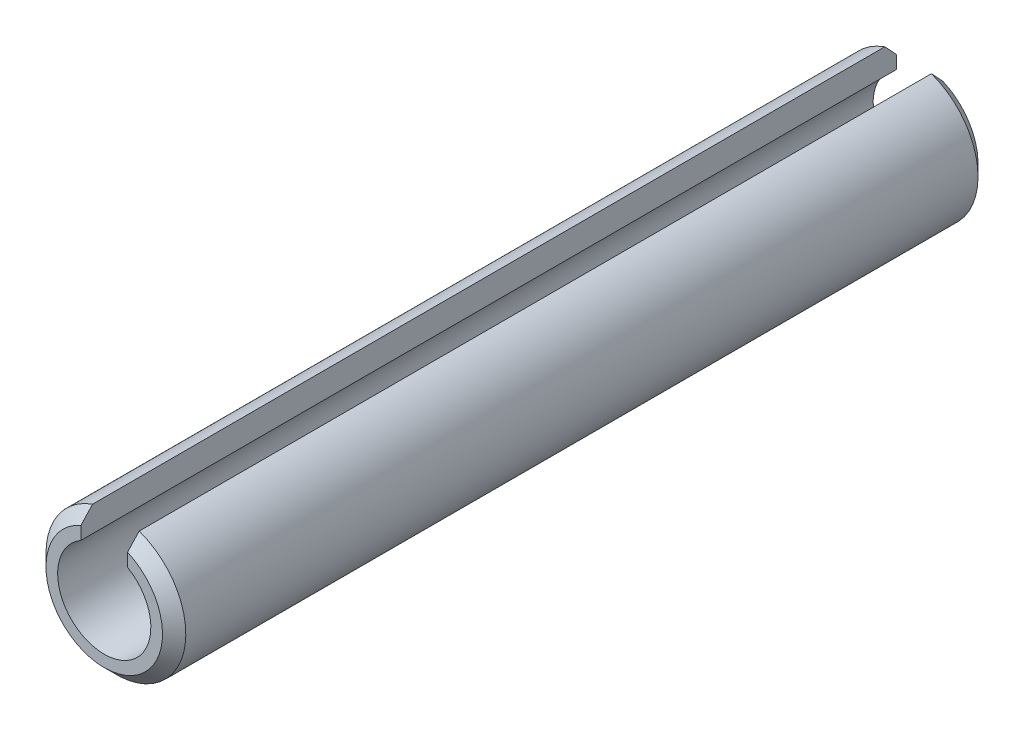
ISO-10303-21;
HEADER;
FILE_DESCRIPTION(('STEP AP214'),'2;1');
FILE_NAME('part.step','',(''),(''),'','','');
FILE_SCHEMA(('AUTOMOTIVE_DESIGN { 1 0 10303 214 1 1 1 1 }'));
ENDSEC;
DATA;
#1=APPLICATION_CONTEXT('core data for automotive mechanical design processes');
#2=APPLICATION_PROTOCOL_DEFINITION('international standard','automotive_design',2000,#1);
#3=PRODUCT_CONTEXT('',#1,'mechanical');
#4=PRODUCT('Part','Part','',(#3));
#5=PRODUCT_RELATED_PRODUCT_CATEGORY('part','',(#4));
#6=PRODUCT_DEFINITION_FORMATION('','',#4);
#7=PRODUCT_DEFINITION_CONTEXT('part definition',#1,'design');
#8=PRODUCT_DEFINITION('design','',#6,#7);
#9=PRODUCT_DEFINITION_SHAPE('','',#8);
#10=(LENGTH_UNIT() NAMED_UNIT(*) SI_UNIT(.MILLI.,.METRE.));
#11=(NAMED_UNIT(*) PLANE_ANGLE_UNIT() SI_UNIT($,.RADIAN.));
#12=(NAMED_UNIT(*) SI_UNIT($,.STERADIAN.) SOLID_ANGLE_UNIT());
#13=UNCERTAINTY_MEASURE_WITH_UNIT(LENGTH_MEASURE(1.E-05),#10,'distance_accuracy_value','');
#14=(GEOMETRIC_REPRESENTATION_CONTEXT(3) GLOBAL_UNCERTAINTY_ASSIGNED_CONTEXT((#13)) GLOBAL_UNIT_ASSIGNED_CONTEXT((#10,
#11,#12)) REPRESENTATION_CONTEXT('',''));
#15=CARTESIAN_POINT('',(0.,0.,0.));
#16=DIRECTION('',(0.,0.,1.));
#17=DIRECTION('',(1.,0.,0.));
#18=AXIS2_PLACEMENT_3D('',#15,#16,#17);
#19=CARTESIAN_POINT('',(0.,0.,35.));
#20=DIRECTION('',(0.,0.,-1.));
#21=DIRECTION('',(-1.,0.,0.));
#22=AXIS2_PLACEMENT_3D('',#19,#20,#21);
#23=CYLINDRICAL_SURFACE('',#22,3.);
#24=DIRECTION('',(0.,0.,-1.));
#25=VECTOR('',#24,1.);
#26=CARTESIAN_POINT('',(-0.999999999999997,2.82842712474619,35.));
#27=LINE('',#26,#25);
#28=CARTESIAN_POINT('',(-0.999999999999997,2.82842712474619,34.5));
#29=VERTEX_POINT('',#28);
#30=CARTESIAN_POINT('',(-0.999999999999997,2.82842712474619,0.5));
#31=VERTEX_POINT('',#30);
#32=EDGE_CURVE('E116',#29,#31,#27,.T.);
#33=ORIENTED_EDGE('',*,*,#32,.T.);
#34=CARTESIAN_POINT('',(0.,0.,0.5));
#35=DIRECTION('',(0.,0.,1.));
#36=DIRECTION('',(1.,0.,0.));
#37=AXIS2_PLACEMENT_3D('',#34,#35,#36);
#38=CIRCLE('',#37,3.);
#39=CARTESIAN_POINT('',(1.,2.82842712474619,0.500000000000001));
#40=VERTEX_POINT('',#39);
#41=EDGE_CURVE('E123',#31,#40,#38,.T.);
#42=ORIENTED_EDGE('',*,*,#41,.T.);
#43=DIRECTION('',(0.,0.,-1.));
#44=VECTOR('',#43,1.);
#45=CARTESIAN_POINT('',(1.,2.82842712474619,35.));
#46=LINE('',#45,#44);
#47=CARTESIAN_POINT('',(1.,2.82842712474619,34.5));
#48=VERTEX_POINT('',#47);
#49=EDGE_CURVE('E103',#48,#40,#46,.T.);
#50=ORIENTED_EDGE('',*,*,#49,.F.);
#51=CARTESIAN_POINT('',(0.,0.,34.5));
#52=DIRECTION('',(0.,0.,1.));
#53=DIRECTION('',(1.,0.,0.));
#54=AXIS2_PLACEMENT_3D('',#51,#52,#53);
#55=CIRCLE('',#54,3.);
#56=EDGE_CURVE('E121',#48,#29,#55,.F.);
#57=ORIENTED_EDGE('',*,*,#56,.T.);
#58=EDGE_LOOP('',(#33,#42,#50,#57));
#59=FACE_BOUND('',#58,.T.);
#60=ADVANCED_FACE('F32',(#59),#23,.T.);
#61=CARTESIAN_POINT('',(1.,2.82842712474619,35.));
#62=DIRECTION('',(1.,0.,0.));
#63=DIRECTION('',(0.,0.,-1.));
#64=AXIS2_PLACEMENT_3D('',#61,#62,#63);
#65=PLANE('',#64);
#66=ORIENTED_EDGE('',*,*,#49,.T.);
#67=CARTESIAN_POINT('',(1.,2.82842712474619,0.5));
#68=CARTESIAN_POINT('',(1.,2.78393060243607,0.458049299682896));
#69=CARTESIAN_POINT('',(1.,2.73938013855693,0.416155705079881));
#70=CARTESIAN_POINT('',(1.,2.65015403367117,0.332503146617472));
#71=CARTESIAN_POINT('',(1.,2.60547839420257,0.29074418111735));
#72=CARTESIAN_POINT('',(1.,2.51598341720938,0.207380143208967));
#73=CARTESIAN_POINT('',(1.,2.47116407923848,0.165775071279564));
#74=CARTESIAN_POINT('',(1.,2.38135760243373,0.0827453555177404));
#75=CARTESIAN_POINT('',(1.,2.33637046155039,0.0413207139025472));
#76=CARTESIAN_POINT('',(1.,2.29128784747792,0.));
#77=B_SPLINE_CURVE_WITH_KNOTS('',3,(#67,#68,#69,#70,#71,#72,#73,#74,#75,#76),.UNSPECIFIED.,.F.,
.F.,(4,2,2,2,4),(0.,0.183461811793637,0.366921379215902,0.550381517014302,0.733843902947407),.UNSPECIFIED.);
#78=CARTESIAN_POINT('',(1.,2.29128784747792,0.));
#79=VERTEX_POINT('',#78);
#80=EDGE_CURVE('E94',#40,#79,#77,.T.);
#81=ORIENTED_EDGE('',*,*,#80,.T.);
#82=DIRECTION('',(0.,-1.,0.));
#83=VECTOR('',#82,1.);
#84=CARTESIAN_POINT('',(1.,2.82842712474619,0.));
#85=LINE('',#84,#83);
#86=CARTESIAN_POINT('',(1.,1.73205080756888,0.));
#87=VERTEX_POINT('',#86);
#88=EDGE_CURVE('E87',#79,#87,#85,.T.);
#89=ORIENTED_EDGE('',*,*,#88,.T.);
#90=DIRECTION('',(0.,0.,-1.));
#91=VECTOR('',#90,1.);
#92=CARTESIAN_POINT('',(1.,1.73205080756888,35.));
#93=LINE('',#92,#91);
#94=CARTESIAN_POINT('',(1.,1.73205080756888,35.));
#95=VERTEX_POINT('',#94);
#96=EDGE_CURVE('E92',#95,#87,#93,.T.);
#97=ORIENTED_EDGE('',*,*,#96,.F.);
#98=DIRECTION('',(0.,-1.,0.));
#99=VECTOR('',#98,1.);
#100=CARTESIAN_POINT('',(1.,2.82842712474619,35.));
#101=LINE('',#100,#99);
#102=CARTESIAN_POINT('',(1.,2.29128784747792,35.));
#103=VERTEX_POINT('',#102);
#104=EDGE_CURVE('E109',#103,#95,#101,.T.);
#105=ORIENTED_EDGE('',*,*,#104,.F.);
#106=CARTESIAN_POINT('',(1.,2.29128784747792,35.));
#107=CARTESIAN_POINT('',(1.,2.33637046155038,34.9586792860974));
#108=CARTESIAN_POINT('',(1.,2.38135760243373,34.9172546444823));
#109=CARTESIAN_POINT('',(1.,2.47116407923848,34.8342249287204));
#110=CARTESIAN_POINT('',(1.,2.51598341720938,34.792619856791));
#111=CARTESIAN_POINT('',(1.,2.60547839420257,34.7092558188827));
#112=CARTESIAN_POINT('',(1.,2.65015403367117,34.6674968533825));
#113=CARTESIAN_POINT('',(1.,2.73938013855693,34.5838442949201));
#114=CARTESIAN_POINT('',(1.,2.78393060243607,34.5419507003171));
#115=CARTESIAN_POINT('',(1.,2.82842712474619,34.5));
#116=B_SPLINE_CURVE_WITH_KNOTS('',3,(#106,#107,#108,#109,#110,#111,#112,#113,#114,#115),
.UNSPECIFIED.,.F.,.F.,(4,2,2,2,4),(0.,0.183462385933106,0.366922523731505,0.550382091153768,
0.733843902947405),.UNSPECIFIED.);
#117=EDGE_CURVE('E126',#103,#48,#116,.T.);
#118=ORIENTED_EDGE('',*,*,#117,.T.);
#119=EDGE_LOOP('',(#66,#81,#89,#97,#105,#118));
#120=FACE_BOUND('',#119,.T.);
#121=ADVANCED_FACE('F90',(#120),#65,.F.);
#122=CARTESIAN_POINT('',(0.,0.,35.));
#123=DIRECTION('',(0.,0.,-1.));
#124=DIRECTION('',(-1.,0.,0.));
#125=AXIS2_PLACEMENT_3D('',#122,#123,#124);
#126=CYLINDRICAL_SURFACE('',#125,2.);
#127=CARTESIAN_POINT('',(0.,0.,0.));
#128=DIRECTION('',(0.,0.,-1.));
#129=DIRECTION('',(1.,0.,0.));
#130=AXIS2_PLACEMENT_3D('',#127,#128,#129);
#131=CIRCLE('',#130,2.);
#132=CARTESIAN_POINT('',(-0.999999999999998,1.73205080756888,0.));
#133=VERTEX_POINT('',#132);
#134=EDGE_CURVE('E96',#87,#133,#131,.T.);
#135=ORIENTED_EDGE('',*,*,#134,.T.);
#136=DIRECTION('',(0.,0.,-1.));
#137=VECTOR('',#136,1.);
#138=CARTESIAN_POINT('',(-0.999999999999998,1.73205080756888,35.));
#139=LINE('',#138,#137);
#140=CARTESIAN_POINT('',(-0.999999999999998,1.73205080756888,35.));
#141=VERTEX_POINT('',#140);
#142=EDGE_CURVE('E104',#141,#133,#139,.T.);
#143=ORIENTED_EDGE('',*,*,#142,.F.);
#144=CARTESIAN_POINT('',(0.,0.,35.));
#145=DIRECTION('',(0.,0.,-1.));
#146=DIRECTION('',(1.,0.,0.));
#147=AXIS2_PLACEMENT_3D('',#144,#145,#146);
#148=CIRCLE('',#147,2.);
#149=EDGE_CURVE('E102',#95,#141,#148,.T.);
#150=ORIENTED_EDGE('',*,*,#149,.F.);
#151=ORIENTED_EDGE('',*,*,#96,.T.);
#152=EDGE_LOOP('',(#135,#143,#150,#151));
#153=FACE_BOUND('',#152,.T.);
#154=ADVANCED_FACE('F99',(#153),#126,.F.);
#155=CARTESIAN_POINT('',(-0.999999999999997,2.82842712474619,35.));
#156=DIRECTION('',(-1.,0.,0.));
#157=DIRECTION('',(0.,0.,1.));
#158=AXIS2_PLACEMENT_3D('',#155,#156,#157);
#159=PLANE('',#158);
#160=DIRECTION('',(0.,1.,0.));
#161=VECTOR('',#160,1.);
#162=CARTESIAN_POINT('',(-0.999999999999997,2.82842712474619,0.));
#163=LINE('',#162,#161);
#164=CARTESIAN_POINT('',(-0.999999999999997,2.29128784747792,0.));
#165=VERTEX_POINT('',#164);
#166=EDGE_CURVE('E107',#133,#165,#163,.T.);
#167=ORIENTED_EDGE('',*,*,#166,.T.);
#168=CARTESIAN_POINT('',(-0.999999999999997,2.29128784747792,0.));
#169=CARTESIAN_POINT('',(-0.999999999999997,2.33637046155039,0.0413207139025474));
#170=CARTESIAN_POINT('',(-0.999999999999997,2.38135760243374,0.0827453555177403));
#171=CARTESIAN_POINT('',(-0.999999999999997,2.47116407923848,0.165775071279564));
#172=CARTESIAN_POINT('',(-0.999999999999997,2.51598341720939,0.207380143208967));
#173=CARTESIAN_POINT('',(-0.999999999999997,2.60547839420257,0.29074418111735));
#174=CARTESIAN_POINT('',(-0.999999999999997,2.65015403367117,0.332503146617472));
#175=CARTESIAN_POINT('',(-0.999999999999997,2.73938013855693,0.416155705079881));
#176=CARTESIAN_POINT('',(-0.999999999999997,2.78393060243607,0.458049299682896));
#177=CARTESIAN_POINT('',(-0.999999999999997,2.82842712474619,0.5));
#178=B_SPLINE_CURVE_WITH_KNOTS('',3,(#168,#169,#170,#171,#172,#173,#174,#175,#176,#177),
.UNSPECIFIED.,.F.,.F.,(4,2,2,2,4),(0.,0.183462385933105,0.366922523731505,0.55038209115377,
0.733843902947406),.UNSPECIFIED.);
#179=EDGE_CURVE('E39',#165,#31,#178,.T.);
#180=ORIENTED_EDGE('',*,*,#179,.T.);
#181=ORIENTED_EDGE('',*,*,#32,.F.);
#182=CARTESIAN_POINT('',(-0.999999999999998,2.82842712474619,34.5));
#183=CARTESIAN_POINT('',(-0.999999999999997,2.78393060243607,34.5419507003171));
#184=CARTESIAN_POINT('',(-0.999999999999997,2.73938013855693,34.5838442949201));
#185=CARTESIAN_POINT('',(-0.999999999999997,2.65015403367117,34.6674968533825));
#186=CARTESIAN_POINT('',(-0.999999999999997,2.60547839420257,34.7092558188827));
#187=CARTESIAN_POINT('',(-0.999999999999997,2.51598341720939,34.792619856791));
#188=CARTESIAN_POINT('',(-0.999999999999997,2.47116407923848,34.8342249287204));
#189=CARTESIAN_POINT('',(-0.999999999999997,2.38135760243374,34.9172546444823));
#190=CARTESIAN_POINT('',(-0.999999999999997,2.33637046155039,34.9586792860974));
#191=CARTESIAN_POINT('',(-0.999999999999997,2.29128784747792,35.));
#192=B_SPLINE_CURVE_WITH_KNOTS('',3,(#182,#183,#184,#185,#186,#187,#188,#189,#190,#191),
.UNSPECIFIED.,.F.,.F.,(4,2,2,2,4),(0.,0.183461811793637,0.366921379215902,0.5503815170143,
0.733843902947406),.UNSPECIFIED.);
#193=CARTESIAN_POINT('',(-0.999999999999997,2.29128784747792,35.));
#194=VERTEX_POINT('',#193);
#195=EDGE_CURVE('E46',#29,#194,#192,.T.);
#196=ORIENTED_EDGE('',*,*,#195,.T.);
#197=DIRECTION('',(0.,1.,0.));
#198=VECTOR('',#197,1.);
#199=CARTESIAN_POINT('',(-0.999999999999997,2.82842712474619,35.));
#200=LINE('',#199,#198);
#201=EDGE_CURVE('E114',#141,#194,#200,.T.);
#202=ORIENTED_EDGE('',*,*,#201,.F.);
#203=ORIENTED_EDGE('',*,*,#142,.T.);
#204=EDGE_LOOP('',(#167,#180,#181,#196,#202,#203));
#205=FACE_BOUND('',#204,.T.);
#206=ADVANCED_FACE('F145',(#205),#159,.F.);
#207=CARTESIAN_POINT('',(0.,0.,35.));
#208=DIRECTION('',(0.,0.,1.));
#209=DIRECTION('',(1.,0.,0.));
#210=AXIS2_PLACEMENT_3D('',#207,#208,#209);
#211=PLANE('',#210);
#212=ORIENTED_EDGE('',*,*,#201,.T.);
#213=CARTESIAN_POINT('',(0.,0.,35.));
#214=DIRECTION('',(0.,0.,1.));
#215=DIRECTION('',(1.,0.,0.));
#216=AXIS2_PLACEMENT_3D('',#213,#214,#215);
#217=CIRCLE('',#216,2.5);
#218=EDGE_CURVE('E11',#194,#103,#217,.T.);
#219=ORIENTED_EDGE('',*,*,#218,.T.);
#220=ORIENTED_EDGE('',*,*,#104,.T.);
#221=ORIENTED_EDGE('',*,*,#149,.T.);
#222=EDGE_LOOP('',(#212,#219,#220,#221));
#223=FACE_BOUND('',#222,.T.);
#224=ADVANCED_FACE('F149',(#223),#211,.T.);
#225=CARTESIAN_POINT('',(0.,0.,0.));
#226=DIRECTION('',(0.,0.,1.));
#227=DIRECTION('',(1.,0.,0.));
#228=AXIS2_PLACEMENT_3D('',#225,#226,#227);
#229=PLANE('',#228);
#230=ORIENTED_EDGE('',*,*,#88,.F.);
#231=CARTESIAN_POINT('',(0.,0.,0.));
#232=DIRECTION('',(0.,0.,1.));
#233=DIRECTION('',(1.,0.,0.));
#234=AXIS2_PLACEMENT_3D('',#231,#232,#233);
#235=CIRCLE('',#234,2.5);
#236=EDGE_CURVE('E54',#79,#165,#235,.F.);
#237=ORIENTED_EDGE('',*,*,#236,.T.);
#238=ORIENTED_EDGE('',*,*,#166,.F.);
#239=ORIENTED_EDGE('',*,*,#134,.F.);
#240=EDGE_LOOP('',(#230,#237,#238,#239));
#241=FACE_BOUND('',#240,.T.);
#242=ADVANCED_FACE('F106',(#241),#229,.F.);
#243=CARTESIAN_POINT('',(0.,0.,0.5));
#244=DIRECTION('',(0.,0.,1.));
#245=DIRECTION('',(1.,0.,0.));
#246=AXIS2_PLACEMENT_3D('',#243,#244,#245);
#247=CONICAL_SURFACE('',#246,3.,0.785398163397449);
#248=ORIENTED_EDGE('',*,*,#179,.F.);
#249=ORIENTED_EDGE('',*,*,#236,.F.);
#250=ORIENTED_EDGE('',*,*,#80,.F.);
#251=ORIENTED_EDGE('',*,*,#41,.F.);
#252=EDGE_LOOP('',(#248,#249,#250,#251));
#253=FACE_BOUND('',#252,.T.);
#254=ADVANCED_FACE('F159',(#253),#247,.T.);
#255=CARTESIAN_POINT('',(0.,0.,35.));
#256=DIRECTION('',(0.,0.,-1.));
#257=DIRECTION('',(-1.,0.,0.));
#258=AXIS2_PLACEMENT_3D('',#255,#256,#257);
#259=CONICAL_SURFACE('',#258,2.5,0.785398163397448);
#260=ORIENTED_EDGE('',*,*,#195,.F.);
#261=ORIENTED_EDGE('',*,*,#56,.F.);
#262=ORIENTED_EDGE('',*,*,#117,.F.);
#263=ORIENTED_EDGE('',*,*,#218,.F.);
#264=EDGE_LOOP('',(#260,#261,#262,#263));
#265=FACE_BOUND('',#264,.T.);
#266=ADVANCED_FACE('F137',(#265),#259,.T.);
#267=CLOSED_SHELL('',(#60,#121,#154,#206,#224,#242,#254,#266));
#268=MANIFOLD_SOLID_BREP('B2',#267);
#269=ADVANCED_BREP_SHAPE_REPRESENTATION('',(#18,#268),#14);
#270=SHAPE_DEFINITION_REPRESENTATION(#9,#269);
ENDSEC;
END-ISO-10303-21;
